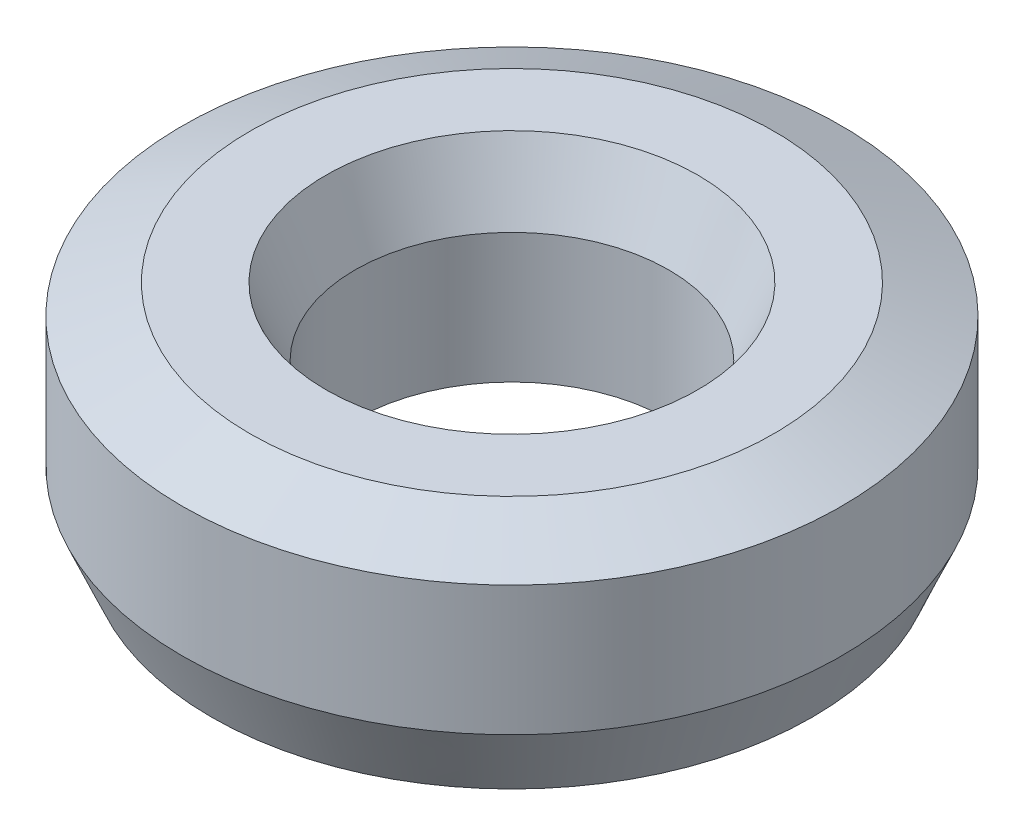
ISO-10303-21;
HEADER;
FILE_DESCRIPTION(('STEP AP214'),'2;1');
FILE_NAME('part.step','',(''),(''),'','','');
FILE_SCHEMA(('AUTOMOTIVE_DESIGN { 1 0 10303 214 1 1 1 1 }'));
ENDSEC;
DATA;
#1=APPLICATION_CONTEXT('core data for automotive mechanical design processes');
#2=APPLICATION_PROTOCOL_DEFINITION('international standard','automotive_design',2000,#1);
#3=PRODUCT_CONTEXT('',#1,'mechanical');
#4=PRODUCT('Part','Part','',(#3));
#5=PRODUCT_RELATED_PRODUCT_CATEGORY('part','',(#4));
#6=PRODUCT_DEFINITION_FORMATION('','',#4);
#7=PRODUCT_DEFINITION_CONTEXT('part definition',#1,'design');
#8=PRODUCT_DEFINITION('design','',#6,#7);
#9=PRODUCT_DEFINITION_SHAPE('','',#8);
#10=(LENGTH_UNIT() NAMED_UNIT(*) SI_UNIT(.MILLI.,.METRE.));
#11=(NAMED_UNIT(*) PLANE_ANGLE_UNIT() SI_UNIT($,.RADIAN.));
#12=(NAMED_UNIT(*) SI_UNIT($,.STERADIAN.) SOLID_ANGLE_UNIT());
#13=UNCERTAINTY_MEASURE_WITH_UNIT(LENGTH_MEASURE(1.E-05),#10,'distance_accuracy_value','');
#14=(GEOMETRIC_REPRESENTATION_CONTEXT(3) GLOBAL_UNCERTAINTY_ASSIGNED_CONTEXT((#13)) GLOBAL_UNIT_ASSIGNED_CONTEXT((#10,
#11,#12)) REPRESENTATION_CONTEXT('',''));
#15=CARTESIAN_POINT('',(0.,0.,0.));
#16=DIRECTION('',(0.,0.,1.));
#17=DIRECTION('',(1.,0.,0.));
#18=AXIS2_PLACEMENT_3D('',#15,#16,#17);
#19=CARTESIAN_POINT('',(0.,5.14886962501385,0.));
#20=DIRECTION('',(0.,-1.,0.));
#21=DIRECTION('',(0.,0.,-1.));
#22=AXIS2_PLACEMENT_3D('',#19,#20,#21);
#23=CYLINDRICAL_SURFACE('',#22,7.5);
#24=CARTESIAN_POINT('',(0.,1.53696284423514,0.));
#25=DIRECTION('',(0.,1.,0.));
#26=DIRECTION('',(0.,0.,1.));
#27=AXIS2_PLACEMENT_3D('',#24,#25,#26);
#28=CIRCLE('',#27,7.5);
#29=CARTESIAN_POINT('',(0.,1.53696284423514,7.5));
#30=VERTEX_POINT('',#29);
#31=EDGE_CURVE('E10',#30,#30,#28,.T.);
#32=ORIENTED_EDGE('',*,*,#31,.T.);
#33=EDGE_LOOP('',(#32));
#34=FACE_BOUND('',#33,.T.);
#35=CARTESIAN_POINT('',(0.,4.48682172533359,0.));
#36=DIRECTION('',(0.,1.,0.));
#37=DIRECTION('',(0.,0.,1.));
#38=AXIS2_PLACEMENT_3D('',#35,#36,#37);
#39=CIRCLE('',#38,7.5);
#40=CARTESIAN_POINT('',(0.,4.48682172533359,7.5));
#41=VERTEX_POINT('',#40);
#42=EDGE_CURVE('E50',#41,#41,#39,.F.);
#43=ORIENTED_EDGE('',*,*,#42,.T.);
#44=EDGE_LOOP('',(#43));
#45=FACE_BOUND('',#44,.T.);
#46=ADVANCED_FACE('F39',(#34,#45),#23,.T.);
#47=CARTESIAN_POINT('',(0.,5.14886962501385,0.));
#48=DIRECTION('',(0.,1.,0.));
#49=DIRECTION('',(0.,0.,1.));
#50=AXIS2_PLACEMENT_3D('',#47,#48,#49);
#51=PLANE('',#50);
#52=CARTESIAN_POINT('',(0.,5.14886962501385,0.));
#53=DIRECTION('',(0.,1.,0.));
#54=DIRECTION('',(0.,0.,1.));
#55=AXIS2_PLACEMENT_3D('',#52,#53,#54);
#56=CIRCLE('',#55,4.23209889170677);
#57=CARTESIAN_POINT('',(0.,5.14886962501385,4.23209889170677));
#58=VERTEX_POINT('',#57);
#59=EDGE_CURVE('E58',#58,#58,#56,.F.);
#60=ORIENTED_EDGE('',*,*,#59,.T.);
#61=EDGE_LOOP('',(#60));
#62=FACE_BOUND('',#61,.T.);
#63=CARTESIAN_POINT('',(0.,5.14886962501385,0.));
#64=DIRECTION('',(0.,1.,0.));
#65=DIRECTION('',(0.,0.,1.));
#66=AXIS2_PLACEMENT_3D('',#63,#64,#65);
#67=CIRCLE('',#66,5.96303715576485);
#68=CARTESIAN_POINT('',(0.,5.14886962501385,5.96303715576485));
#69=VERTEX_POINT('',#68);
#70=EDGE_CURVE('E61',#69,#69,#67,.T.);
#71=ORIENTED_EDGE('',*,*,#70,.T.);
#72=EDGE_LOOP('',(#71));
#73=FACE_BOUND('',#72,.T.);
#74=ADVANCED_FACE('F88',(#62,#73),#51,.T.);
#75=CARTESIAN_POINT('',(0.,0.,0.));
#76=DIRECTION('',(0.,1.,0.));
#77=DIRECTION('',(0.,0.,1.));
#78=AXIS2_PLACEMENT_3D('',#75,#76,#77);
#79=PLANE('',#78);
#80=CARTESIAN_POINT('',(0.,0.,0.));
#81=DIRECTION('',(0.,1.,0.));
#82=DIRECTION('',(0.,0.,1.));
#83=AXIS2_PLACEMENT_3D('',#80,#81,#82);
#84=CIRCLE('',#83,5.10701383626166);
#85=CARTESIAN_POINT('',(0.,0.,5.10701383626166));
#86=VERTEX_POINT('',#85);
#87=EDGE_CURVE('E51',#86,#86,#84,.T.);
#88=ORIENTED_EDGE('',*,*,#87,.T.);
#89=EDGE_LOOP('',(#88));
#90=FACE_BOUND('',#89,.T.);
#91=CARTESIAN_POINT('',(0.,0.,0.));
#92=DIRECTION('',(0.,1.,0.));
#93=DIRECTION('',(0.,0.,1.));
#94=AXIS2_PLACEMENT_3D('',#91,#92,#93);
#95=CIRCLE('',#94,6.83795210031973);
#96=CARTESIAN_POINT('',(0.,0.,6.83795210031973));
#97=VERTEX_POINT('',#96);
#98=EDGE_CURVE('E54',#97,#97,#95,.F.);
#99=ORIENTED_EDGE('',*,*,#98,.T.);
#100=EDGE_LOOP('',(#99));
#101=FACE_BOUND('',#100,.T.);
#102=ADVANCED_FACE('F83',(#90,#101),#79,.F.);
#103=CARTESIAN_POINT('',(0.,5.14886962501385,0.));
#104=DIRECTION('',(0.,-1.,0.));
#105=DIRECTION('',(0.,0.,-1.));
#106=AXIS2_PLACEMENT_3D('',#103,#104,#105);
#107=CYLINDRICAL_SURFACE('',#106,3.5700509920265);
#108=CARTESIAN_POINT('',(0.,3.6119067807787,0.));
#109=DIRECTION('',(0.,1.,0.));
#110=DIRECTION('',(0.,0.,1.));
#111=AXIS2_PLACEMENT_3D('',#108,#109,#110);
#112=CIRCLE('',#111,3.5700509920265);
#113=CARTESIAN_POINT('',(0.,3.6119067807787,3.5700509920265));
#114=VERTEX_POINT('',#113);
#115=EDGE_CURVE('E67',#114,#114,#112,.T.);
#116=ORIENTED_EDGE('',*,*,#115,.T.);
#117=EDGE_LOOP('',(#116));
#118=FACE_BOUND('',#117,.T.);
#119=CARTESIAN_POINT('',(0.,0.662047899680273,0.));
#120=DIRECTION('',(0.,1.,0.));
#121=DIRECTION('',(0.,0.,1.));
#122=AXIS2_PLACEMENT_3D('',#119,#120,#121);
#123=CIRCLE('',#122,3.5700509920265);
#124=CARTESIAN_POINT('',(0.,0.662047899680273,3.5700509920265));
#125=VERTEX_POINT('',#124);
#126=EDGE_CURVE('E69',#125,#125,#123,.F.);
#127=ORIENTED_EDGE('',*,*,#126,.T.);
#128=EDGE_LOOP('',(#127));
#129=FACE_BOUND('',#128,.T.);
#130=ADVANCED_FACE('F71',(#118,#129),#107,.F.);
#131=CARTESIAN_POINT('',(0.,3.6119067807787,0.));
#132=DIRECTION('',(0.,1.,0.));
#133=DIRECTION('',(0.,0.,1.));
#134=AXIS2_PLACEMENT_3D('',#131,#132,#133);
#135=CONICAL_SURFACE('',#134,3.5700509920265,0.406731484420002);
#136=ORIENTED_EDGE('',*,*,#59,.F.);
#137=EDGE_LOOP('',(#136));
#138=FACE_BOUND('',#137,.T.);
#139=ORIENTED_EDGE('',*,*,#115,.F.);
#140=EDGE_LOOP('',(#139));
#141=FACE_BOUND('',#140,.T.);
#142=ADVANCED_FACE('F77',(#138,#141),#135,.F.);
#143=CARTESIAN_POINT('',(0.,0.,0.));
#144=DIRECTION('',(0.,-1.,0.));
#145=DIRECTION('',(0.,0.,-1.));
#146=AXIS2_PLACEMENT_3D('',#143,#144,#145);
#147=CONICAL_SURFACE('',#146,5.10701383626166,1.1640648423749);
#148=ORIENTED_EDGE('',*,*,#126,.F.);
#149=EDGE_LOOP('',(#148));
#150=FACE_BOUND('',#149,.T.);
#151=ORIENTED_EDGE('',*,*,#87,.F.);
#152=EDGE_LOOP('',(#151));
#153=FACE_BOUND('',#152,.T.);
#154=ADVANCED_FACE('F73',(#150,#153),#147,.F.);
#155=CARTESIAN_POINT('',(0.,1.53696284423514,0.));
#156=DIRECTION('',(0.,1.,0.));
#157=DIRECTION('',(0.,0.,1.));
#158=AXIS2_PLACEMENT_3D('',#155,#156,#157);
#159=CONICAL_SURFACE('',#158,7.5,0.406731484420002);
#160=ORIENTED_EDGE('',*,*,#98,.F.);
#161=EDGE_LOOP('',(#160));
#162=FACE_BOUND('',#161,.T.);
#163=ORIENTED_EDGE('',*,*,#31,.F.);
#164=EDGE_LOOP('',(#163));
#165=FACE_BOUND('',#164,.T.);
#166=ADVANCED_FACE('F76',(#162,#165),#159,.T.);
#167=CARTESIAN_POINT('',(0.,5.14886962501385,0.));
#168=DIRECTION('',(0.,-1.,0.));
#169=DIRECTION('',(0.,0.,-1.));
#170=AXIS2_PLACEMENT_3D('',#167,#168,#169);
#171=CONICAL_SURFACE('',#170,5.96303715576485,1.16406484237489);
#172=ORIENTED_EDGE('',*,*,#42,.F.);
#173=EDGE_LOOP('',(#172));
#174=FACE_BOUND('',#173,.T.);
#175=ORIENTED_EDGE('',*,*,#70,.F.);
#176=EDGE_LOOP('',(#175));
#177=FACE_BOUND('',#176,.T.);
#178=ADVANCED_FACE('F45',(#174,#177),#171,.T.);
#179=CLOSED_SHELL('',(#46,#74,#102,#130,#142,#154,#166,#178));
#180=MANIFOLD_SOLID_BREP('B2',#179);
#181=ADVANCED_BREP_SHAPE_REPRESENTATION('',(#18,#180),#14);
#182=SHAPE_DEFINITION_REPRESENTATION(#9,#181);
ENDSEC;
END-ISO-10303-21;
